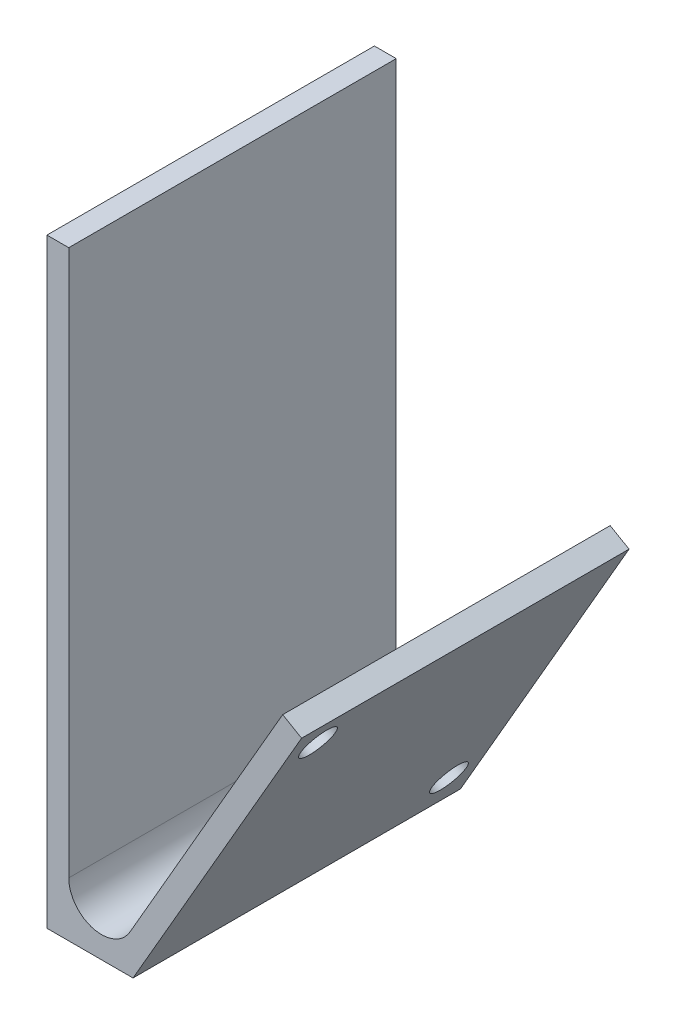
ISO-10303-21;
HEADER;
FILE_DESCRIPTION(('STEP AP214'),'2;1');
FILE_NAME('part.step','',(''),(''),'','','');
FILE_SCHEMA(('AUTOMOTIVE_DESIGN { 1 0 10303 214 1 1 1 1 }'));
ENDSEC;
DATA;
#1=APPLICATION_CONTEXT('core data for automotive mechanical design processes');
#2=APPLICATION_PROTOCOL_DEFINITION('international standard','automotive_design',2000,#1);
#3=PRODUCT_CONTEXT('',#1,'mechanical');
#4=PRODUCT('Part','Part','',(#3));
#5=PRODUCT_RELATED_PRODUCT_CATEGORY('part','',(#4));
#6=PRODUCT_DEFINITION_FORMATION('','',#4);
#7=PRODUCT_DEFINITION_CONTEXT('part definition',#1,'design');
#8=PRODUCT_DEFINITION('design','',#6,#7);
#9=PRODUCT_DEFINITION_SHAPE('','',#8);
#10=(LENGTH_UNIT() NAMED_UNIT(*) SI_UNIT(.MILLI.,.METRE.));
#11=(NAMED_UNIT(*) PLANE_ANGLE_UNIT() SI_UNIT($,.RADIAN.));
#12=(NAMED_UNIT(*) SI_UNIT($,.STERADIAN.) SOLID_ANGLE_UNIT());
#13=UNCERTAINTY_MEASURE_WITH_UNIT(LENGTH_MEASURE(1.E-05),#10,'distance_accuracy_value','');
#14=(GEOMETRIC_REPRESENTATION_CONTEXT(3) GLOBAL_UNCERTAINTY_ASSIGNED_CONTEXT((#13)) GLOBAL_UNIT_ASSIGNED_CONTEXT((#10,
#11,#12)) REPRESENTATION_CONTEXT('',''));
#15=CARTESIAN_POINT('',(0.,0.,0.));
#16=DIRECTION('',(0.,0.,1.));
#17=DIRECTION('',(1.,0.,0.));
#18=AXIS2_PLACEMENT_3D('',#15,#16,#17);
#19=CARTESIAN_POINT('',(2.,55.,30.));
#20=DIRECTION('',(0.,-1.,0.));
#21=DIRECTION('',(0.,0.,-1.));
#22=AXIS2_PLACEMENT_3D('',#19,#20,#21);
#23=PLANE('',#22);
#24=DIRECTION('',(-1.,0.,0.));
#25=VECTOR('',#24,1.);
#26=CARTESIAN_POINT('',(2.,55.,0.));
#27=LINE('',#26,#25);
#28=CARTESIAN_POINT('',(2.,55.,0.));
#29=VERTEX_POINT('',#28);
#30=CARTESIAN_POINT('',(0.,55.,0.));
#31=VERTEX_POINT('',#30);
#32=EDGE_CURVE('E139',#29,#31,#27,.T.);
#33=ORIENTED_EDGE('',*,*,#32,.T.);
#34=DIRECTION('',(0.,0.,-1.));
#35=VECTOR('',#34,1.);
#36=CARTESIAN_POINT('',(0.,55.,30.));
#37=LINE('',#36,#35);
#38=CARTESIAN_POINT('',(0.,55.,30.));
#39=VERTEX_POINT('',#38);
#40=EDGE_CURVE('E11',#39,#31,#37,.T.);
#41=ORIENTED_EDGE('',*,*,#40,.F.);
#42=DIRECTION('',(-1.,0.,0.));
#43=VECTOR('',#42,1.);
#44=CARTESIAN_POINT('',(2.,55.,30.));
#45=LINE('',#44,#43);
#46=CARTESIAN_POINT('',(2.,55.,30.));
#47=VERTEX_POINT('',#46);
#48=EDGE_CURVE('E157',#47,#39,#45,.T.);
#49=ORIENTED_EDGE('',*,*,#48,.F.);
#50=DIRECTION('',(0.,0.,-1.));
#51=VECTOR('',#50,1.);
#52=CARTESIAN_POINT('',(2.,55.,30.));
#53=LINE('',#52,#51);
#54=EDGE_CURVE('E135',#47,#29,#53,.T.);
#55=ORIENTED_EDGE('',*,*,#54,.T.);
#56=EDGE_LOOP('',(#33,#41,#49,#55));
#57=FACE_BOUND('',#56,.T.);
#58=ADVANCED_FACE('F33',(#57),#23,.F.);
#59=CARTESIAN_POINT('',(0.,55.,30.));
#60=DIRECTION('',(1.,0.,0.));
#61=DIRECTION('',(0.,1.,0.));
#62=AXIS2_PLACEMENT_3D('',#59,#60,#61);
#63=PLANE('',#62);
#64=DIRECTION('',(0.,-1.,0.));
#65=VECTOR('',#64,1.);
#66=CARTESIAN_POINT('',(0.,55.,0.));
#67=LINE('',#66,#65);
#68=CARTESIAN_POINT('',(0.,0.,0.));
#69=VERTEX_POINT('',#68);
#70=EDGE_CURVE('E142',#31,#69,#67,.T.);
#71=ORIENTED_EDGE('',*,*,#70,.T.);
#72=DIRECTION('',(0.,0.,-1.));
#73=VECTOR('',#72,1.);
#74=CARTESIAN_POINT('',(0.,0.,30.));
#75=LINE('',#74,#73);
#76=CARTESIAN_POINT('',(0.,0.,30.));
#77=VERTEX_POINT('',#76);
#78=EDGE_CURVE('E40',#77,#69,#75,.T.);
#79=ORIENTED_EDGE('',*,*,#78,.F.);
#80=DIRECTION('',(0.,-1.,0.));
#81=VECTOR('',#80,1.);
#82=CARTESIAN_POINT('',(0.,55.,30.));
#83=LINE('',#82,#81);
#84=EDGE_CURVE('E96',#39,#77,#83,.T.);
#85=ORIENTED_EDGE('',*,*,#84,.F.);
#86=ORIENTED_EDGE('',*,*,#40,.T.);
#87=EDGE_LOOP('',(#71,#79,#85,#86));
#88=FACE_BOUND('',#87,.T.);
#89=ADVANCED_FACE('F215',(#88),#63,.F.);
#90=CARTESIAN_POINT('',(0.,0.,30.));
#91=DIRECTION('',(0.,1.,0.));
#92=DIRECTION('',(0.,0.,1.));
#93=AXIS2_PLACEMENT_3D('',#90,#91,#92);
#94=PLANE('',#93);
#95=DIRECTION('',(1.,0.,0.));
#96=VECTOR('',#95,1.);
#97=CARTESIAN_POINT('',(0.,0.,0.));
#98=LINE('',#97,#96);
#99=CARTESIAN_POINT('',(7.88675134594815,0.,0.));
#100=VERTEX_POINT('',#99);
#101=EDGE_CURVE('E145',#69,#100,#98,.T.);
#102=ORIENTED_EDGE('',*,*,#101,.T.);
#103=DIRECTION('',(0.,0.,-1.));
#104=VECTOR('',#103,1.);
#105=CARTESIAN_POINT('',(7.88675134594815,0.,30.));
#106=LINE('',#105,#104);
#107=CARTESIAN_POINT('',(7.88675134594815,0.,30.));
#108=VERTEX_POINT('',#107);
#109=EDGE_CURVE('E164',#108,#100,#106,.T.);
#110=ORIENTED_EDGE('',*,*,#109,.F.);
#111=DIRECTION('',(1.,0.,0.));
#112=VECTOR('',#111,1.);
#113=CARTESIAN_POINT('',(0.,0.,30.));
#114=LINE('',#113,#112);
#115=EDGE_CURVE('E172',#77,#108,#114,.T.);
#116=ORIENTED_EDGE('',*,*,#115,.F.);
#117=ORIENTED_EDGE('',*,*,#78,.T.);
#118=EDGE_LOOP('',(#102,#110,#116,#117));
#119=FACE_BOUND('',#118,.T.);
#120=ADVANCED_FACE('F170',(#119),#94,.F.);
#121=CARTESIAN_POINT('',(7.88675134594815,0.,30.));
#122=DIRECTION('',(-0.866025403784442,0.499999999999995,0.));
#123=DIRECTION('',(-0.499999999999995,-0.866025403784442,0.));
#124=AXIS2_PLACEMENT_3D('',#121,#122,#123);
#125=PLANE('',#124);
#126=CARTESIAN_POINT('',(21.8301270189221,24.1506350946111,27.));
#127=DIRECTION('',(-0.866025403784442,0.499999999999995,0.));
#128=DIRECTION('',(-0.499999999999995,-0.866025403784442,0.));
#129=AXIS2_PLACEMENT_3D('',#126,#127,#128);
#130=CIRCLE('',#129,1.6);
#131=CARTESIAN_POINT('',(21.0301270189221,22.764994448556,27.));
#132=VERTEX_POINT('',#131);
#133=EDGE_CURVE('E143',#132,#132,#130,.T.);
#134=ORIENTED_EDGE('',*,*,#133,.T.);
#135=EDGE_LOOP('',(#134));
#136=FACE_BOUND('',#135,.T.);
#137=CARTESIAN_POINT('',(9.83012701892221,3.36602540378448,3.00000000000001));
#138=DIRECTION('',(-0.866025403784442,0.499999999999995,0.));
#139=DIRECTION('',(-0.499999999999995,-0.866025403784442,0.));
#140=AXIS2_PLACEMENT_3D('',#137,#138,#139);
#141=CIRCLE('',#140,1.6);
#142=CARTESIAN_POINT('',(9.03012701892222,1.98038475772937,3.00000000000001));
#143=VERTEX_POINT('',#142);
#144=EDGE_CURVE('E193',#143,#143,#141,.T.);
#145=ORIENTED_EDGE('',*,*,#144,.T.);
#146=EDGE_LOOP('',(#145));
#147=FACE_BOUND('',#146,.T.);
#148=DIRECTION('',(0.499999999999995,0.866025403784442,0.));
#149=VECTOR('',#148,1.);
#150=CARTESIAN_POINT('',(7.88675134594815,0.,0.));
#151=LINE('',#150,#149);
#152=CARTESIAN_POINT('',(23.3301270189221,26.7487113059644,0.));
#153=VERTEX_POINT('',#152);
#154=EDGE_CURVE('E147',#100,#153,#151,.T.);
#155=ORIENTED_EDGE('',*,*,#154,.T.);
#156=DIRECTION('',(0.,0.,-1.));
#157=VECTOR('',#156,1.);
#158=CARTESIAN_POINT('',(23.3301270189221,26.7487113059644,30.));
#159=LINE('',#158,#157);
#160=CARTESIAN_POINT('',(23.3301270189221,26.7487113059644,30.));
#161=VERTEX_POINT('',#160);
#162=EDGE_CURVE('E161',#161,#153,#159,.T.);
#163=ORIENTED_EDGE('',*,*,#162,.F.);
#164=DIRECTION('',(0.499999999999995,0.866025403784442,0.));
#165=VECTOR('',#164,1.);
#166=CARTESIAN_POINT('',(7.88675134594815,0.,30.));
#167=LINE('',#166,#165);
#168=EDGE_CURVE('E185',#108,#161,#167,.T.);
#169=ORIENTED_EDGE('',*,*,#168,.F.);
#170=ORIENTED_EDGE('',*,*,#109,.T.);
#171=EDGE_LOOP('',(#155,#163,#169,#170));
#172=FACE_BOUND('',#171,.T.);
#173=ADVANCED_FACE('F181',(#136,#147,#172),#125,.F.);
#174=CARTESIAN_POINT('',(23.3301270189221,26.7487113059644,30.));
#175=DIRECTION('',(-0.499999999999999,-0.866025403784439,0.));
#176=DIRECTION('',(0.866025403784439,-0.499999999999999,0.));
#177=AXIS2_PLACEMENT_3D('',#174,#175,#176);
#178=PLANE('',#177);
#179=DIRECTION('',(-0.866025403784439,0.499999999999999,0.));
#180=VECTOR('',#179,1.);
#181=CARTESIAN_POINT('',(23.3301270189221,26.7487113059644,0.));
#182=LINE('',#181,#180);
#183=CARTESIAN_POINT('',(21.5980762113532,27.7487113059644,0.));
#184=VERTEX_POINT('',#183);
#185=EDGE_CURVE('E149',#153,#184,#182,.T.);
#186=ORIENTED_EDGE('',*,*,#185,.T.);
#187=DIRECTION('',(0.,0.,-1.));
#188=VECTOR('',#187,1.);
#189=CARTESIAN_POINT('',(21.5980762113532,27.7487113059644,30.));
#190=LINE('',#189,#188);
#191=CARTESIAN_POINT('',(21.5980762113532,27.7487113059644,30.));
#192=VERTEX_POINT('',#191);
#193=EDGE_CURVE('E128',#192,#184,#190,.T.);
#194=ORIENTED_EDGE('',*,*,#193,.F.);
#195=DIRECTION('',(-0.866025403784439,0.499999999999999,0.));
#196=VECTOR('',#195,1.);
#197=CARTESIAN_POINT('',(23.3301270189221,26.7487113059644,30.));
#198=LINE('',#197,#196);
#199=EDGE_CURVE('E117',#161,#192,#198,.T.);
#200=ORIENTED_EDGE('',*,*,#199,.F.);
#201=ORIENTED_EDGE('',*,*,#162,.T.);
#202=EDGE_LOOP('',(#186,#194,#200,#201));
#203=FACE_BOUND('',#202,.T.);
#204=ADVANCED_FACE('F184',(#203),#178,.F.);
#205=CARTESIAN_POINT('',(21.5980762113532,27.7487113059644,30.));
#206=DIRECTION('',(0.866025403784441,-0.499999999999995,0.));
#207=DIRECTION('',(0.499999999999995,0.866025403784442,0.));
#208=AXIS2_PLACEMENT_3D('',#205,#206,#207);
#209=PLANE('',#208);
#210=CARTESIAN_POINT('',(20.0980762113532,25.1506350946111,27.));
#211=DIRECTION('',(-0.866025403784442,0.499999999999995,0.));
#212=DIRECTION('',(-0.499999999999995,-0.866025403784442,0.));
#213=AXIS2_PLACEMENT_3D('',#210,#211,#212);
#214=CIRCLE('',#213,1.6);
#215=CARTESIAN_POINT('',(19.2980762113532,23.764994448556,27.));
#216=VERTEX_POINT('',#215);
#217=EDGE_CURVE('E196',#216,#216,#214,.T.);
#218=ORIENTED_EDGE('',*,*,#217,.F.);
#219=EDGE_LOOP('',(#218));
#220=FACE_BOUND('',#219,.T.);
#221=DIRECTION('',(0.,0.,-1.));
#222=VECTOR('',#221,1.);
#223=CARTESIAN_POINT('',(7.59807621135332,3.50000000000002,30.));
#224=LINE('',#223,#222);
#225=CARTESIAN_POINT('',(7.59807621135332,3.50000000000002,1.75100040032033));
#226=VERTEX_POINT('',#225);
#227=CARTESIAN_POINT('',(7.59807621135332,3.50000000000002,0.));
#228=VERTEX_POINT('',#227);
#229=EDGE_CURVE('E131',#226,#228,#224,.T.);
#230=ORIENTED_EDGE('',*,*,#229,.F.);
#231=CARTESIAN_POINT('',(8.09807621135332,4.36602540378447,3.00000000000001));
#232=DIRECTION('',(-0.866025403784442,0.499999999999995,0.));
#233=DIRECTION('',(-0.499999999999995,-0.866025403784442,0.));
#234=AXIS2_PLACEMENT_3D('',#231,#232,#233);
#235=CIRCLE('',#234,1.6);
#236=CARTESIAN_POINT('',(7.59807621135332,3.50000000000002,4.24899959967968));
#237=VERTEX_POINT('',#236);
#238=EDGE_CURVE('E46',#237,#226,#235,.T.);
#239=ORIENTED_EDGE('',*,*,#238,.F.);
#240=CARTESIAN_POINT('',(7.59807621135332,3.50000000000002,30.));
#241=VERTEX_POINT('',#240);
#242=EDGE_CURVE('E123',#241,#237,#224,.T.);
#243=ORIENTED_EDGE('',*,*,#242,.F.);
#244=DIRECTION('',(-0.499999999999995,-0.866025403784442,0.));
#245=VECTOR('',#244,1.);
#246=CARTESIAN_POINT('',(21.5980762113532,27.7487113059644,30.));
#247=LINE('',#246,#245);
#248=EDGE_CURVE('E110',#192,#241,#247,.T.);
#249=ORIENTED_EDGE('',*,*,#248,.F.);
#250=ORIENTED_EDGE('',*,*,#193,.T.);
#251=DIRECTION('',(-0.499999999999995,-0.866025403784442,0.));
#252=VECTOR('',#251,1.);
#253=CARTESIAN_POINT('',(21.5980762113532,27.7487113059644,0.));
#254=LINE('',#253,#252);
#255=EDGE_CURVE('E151',#184,#228,#254,.T.);
#256=ORIENTED_EDGE('',*,*,#255,.T.);
#257=EDGE_LOOP('',(#230,#239,#243,#249,#250,#256));
#258=FACE_BOUND('',#257,.T.);
#259=ADVANCED_FACE('F125',(#220,#258),#209,.F.);
#260=CARTESIAN_POINT('',(5.,5.,30.));
#261=DIRECTION('',(0.,0.,-1.));
#262=DIRECTION('',(-1.,0.,0.));
#263=AXIS2_PLACEMENT_3D('',#260,#261,#262);
#264=CYLINDRICAL_SURFACE('',#263,3.);
#265=CARTESIAN_POINT('',(5.,5.,0.));
#266=DIRECTION('',(0.,0.,-1.));
#267=DIRECTION('',(-1.,0.,0.));
#268=AXIS2_PLACEMENT_3D('',#265,#266,#267);
#269=CIRCLE('',#268,3.);
#270=CARTESIAN_POINT('',(2.,5.,0.));
#271=VERTEX_POINT('',#270);
#272=EDGE_CURVE('E154',#228,#271,#269,.T.);
#273=ORIENTED_EDGE('',*,*,#272,.T.);
#274=DIRECTION('',(0.,0.,-1.));
#275=VECTOR('',#274,1.);
#276=CARTESIAN_POINT('',(2.,5.,30.));
#277=LINE('',#276,#275);
#278=CARTESIAN_POINT('',(2.,5.,30.));
#279=VERTEX_POINT('',#278);
#280=EDGE_CURVE('E133',#279,#271,#277,.T.);
#281=ORIENTED_EDGE('',*,*,#280,.F.);
#282=CARTESIAN_POINT('',(5.,5.,30.));
#283=DIRECTION('',(0.,0.,-1.));
#284=DIRECTION('',(-1.,0.,0.));
#285=AXIS2_PLACEMENT_3D('',#282,#283,#284);
#286=CIRCLE('',#285,3.);
#287=EDGE_CURVE('E114',#241,#279,#286,.T.);
#288=ORIENTED_EDGE('',*,*,#287,.F.);
#289=ORIENTED_EDGE('',*,*,#242,.T.);
#290=EDGE_CURVE('E129',#237,#226,#224,.T.);
#291=ORIENTED_EDGE('',*,*,#290,.T.);
#292=ORIENTED_EDGE('',*,*,#229,.T.);
#293=EDGE_LOOP('',(#273,#281,#288,#289,#291,#292));
#294=FACE_BOUND('',#293,.T.);
#295=ADVANCED_FACE('F132',(#294),#264,.F.);
#296=CARTESIAN_POINT('',(2.,5.,30.));
#297=DIRECTION('',(-1.,0.,0.));
#298=DIRECTION('',(0.,-1.,0.));
#299=AXIS2_PLACEMENT_3D('',#296,#297,#298);
#300=PLANE('',#299);
#301=DIRECTION('',(0.,1.,0.));
#302=VECTOR('',#301,1.);
#303=CARTESIAN_POINT('',(2.,5.,0.));
#304=LINE('',#303,#302);
#305=EDGE_CURVE('E88',#271,#29,#304,.T.);
#306=ORIENTED_EDGE('',*,*,#305,.T.);
#307=ORIENTED_EDGE('',*,*,#54,.F.);
#308=DIRECTION('',(0.,1.,0.));
#309=VECTOR('',#308,1.);
#310=CARTESIAN_POINT('',(2.,5.,30.));
#311=LINE('',#310,#309);
#312=EDGE_CURVE('E55',#279,#47,#311,.T.);
#313=ORIENTED_EDGE('',*,*,#312,.F.);
#314=ORIENTED_EDGE('',*,*,#280,.T.);
#315=EDGE_LOOP('',(#306,#307,#313,#314));
#316=FACE_BOUND('',#315,.T.);
#317=ADVANCED_FACE('F211',(#316),#300,.F.);
#318=CARTESIAN_POINT('',(5.,5.,30.));
#319=DIRECTION('',(0.,0.,-1.));
#320=DIRECTION('',(-1.,0.,0.));
#321=AXIS2_PLACEMENT_3D('',#318,#319,#320);
#322=PLANE('',#321);
#323=ORIENTED_EDGE('',*,*,#48,.T.);
#324=ORIENTED_EDGE('',*,*,#84,.T.);
#325=ORIENTED_EDGE('',*,*,#115,.T.);
#326=ORIENTED_EDGE('',*,*,#168,.T.);
#327=ORIENTED_EDGE('',*,*,#199,.T.);
#328=ORIENTED_EDGE('',*,*,#248,.T.);
#329=ORIENTED_EDGE('',*,*,#287,.T.);
#330=ORIENTED_EDGE('',*,*,#312,.T.);
#331=EDGE_LOOP('',(#323,#324,#325,#326,#327,#328,#329,#330));
#332=FACE_BOUND('',#331,.T.);
#333=ADVANCED_FACE('F112',(#332),#322,.F.);
#334=CARTESIAN_POINT('',(5.,5.,0.));
#335=DIRECTION('',(0.,0.,-1.));
#336=DIRECTION('',(-1.,0.,0.));
#337=AXIS2_PLACEMENT_3D('',#334,#335,#336);
#338=PLANE('',#337);
#339=ORIENTED_EDGE('',*,*,#32,.F.);
#340=ORIENTED_EDGE('',*,*,#305,.F.);
#341=ORIENTED_EDGE('',*,*,#272,.F.);
#342=ORIENTED_EDGE('',*,*,#255,.F.);
#343=ORIENTED_EDGE('',*,*,#185,.F.);
#344=ORIENTED_EDGE('',*,*,#154,.F.);
#345=ORIENTED_EDGE('',*,*,#101,.F.);
#346=ORIENTED_EDGE('',*,*,#70,.F.);
#347=EDGE_LOOP('',(#339,#340,#341,#342,#343,#344,#345,#346));
#348=FACE_BOUND('',#347,.T.);
#349=ADVANCED_FACE('F176',(#348),#338,.T.);
#350=CARTESIAN_POINT('',(34.0788383248866,-10.6339745962154,3.00000000000001));
#351=DIRECTION('',(-0.866025403784441,0.499999999999995,0.));
#352=DIRECTION('',(-0.499999999999995,-0.866025403784442,0.));
#353=AXIS2_PLACEMENT_3D('',#350,#351,#352);
#354=CYLINDRICAL_SURFACE('',#353,1.6);
#355=ORIENTED_EDGE('',*,*,#238,.T.);
#356=EDGE_CURVE('E198',#226,#237,#235,.T.);
#357=ORIENTED_EDGE('',*,*,#356,.T.);
#358=EDGE_LOOP('',(#355,#357));
#359=FACE_BOUND('',#358,.T.);
#360=ORIENTED_EDGE('',*,*,#144,.F.);
#361=EDGE_LOOP('',(#360));
#362=FACE_BOUND('',#361,.T.);
#363=ADVANCED_FACE('F231',(#359,#362),#354,.F.);
#364=CARTESIAN_POINT('',(8.09807621135332,4.36602540378447,3.00000000000001));
#365=DIRECTION('',(-0.866025403784442,0.499999999999995,0.));
#366=DIRECTION('',(-0.499999999999995,-0.866025403784442,0.));
#367=AXIS2_PLACEMENT_3D('',#364,#365,#366);
#368=PLANE('',#367);
#369=ORIENTED_EDGE('',*,*,#290,.F.);
#370=ORIENTED_EDGE('',*,*,#356,.F.);
#371=EDGE_LOOP('',(#369,#370));
#372=FACE_BOUND('',#371,.T.);
#373=ADVANCED_FACE('F235',(#372),#368,.F.);
#374=CARTESIAN_POINT('',(46.0788383248864,10.1506350946112,27.));
#375=DIRECTION('',(-0.866025403784441,0.499999999999995,0.));
#376=DIRECTION('',(-0.499999999999995,-0.866025403784442,0.));
#377=AXIS2_PLACEMENT_3D('',#374,#375,#376);
#378=CYLINDRICAL_SURFACE('',#377,1.6);
#379=ORIENTED_EDGE('',*,*,#217,.T.);
#380=EDGE_LOOP('',(#379));
#381=FACE_BOUND('',#380,.T.);
#382=ORIENTED_EDGE('',*,*,#133,.F.);
#383=EDGE_LOOP('',(#382));
#384=FACE_BOUND('',#383,.T.);
#385=ADVANCED_FACE('F202',(#381,#384),#378,.F.);
#386=CLOSED_SHELL('',(#58,#89,#120,#173,#204,#259,#295,#317,#333,#349,#363,#373,#385));
#387=MANIFOLD_SOLID_BREP('B2',#386);
#388=ADVANCED_BREP_SHAPE_REPRESENTATION('',(#18,#387),#14);
#389=SHAPE_DEFINITION_REPRESENTATION(#9,#388);
ENDSEC;
END-ISO-10303-21;
